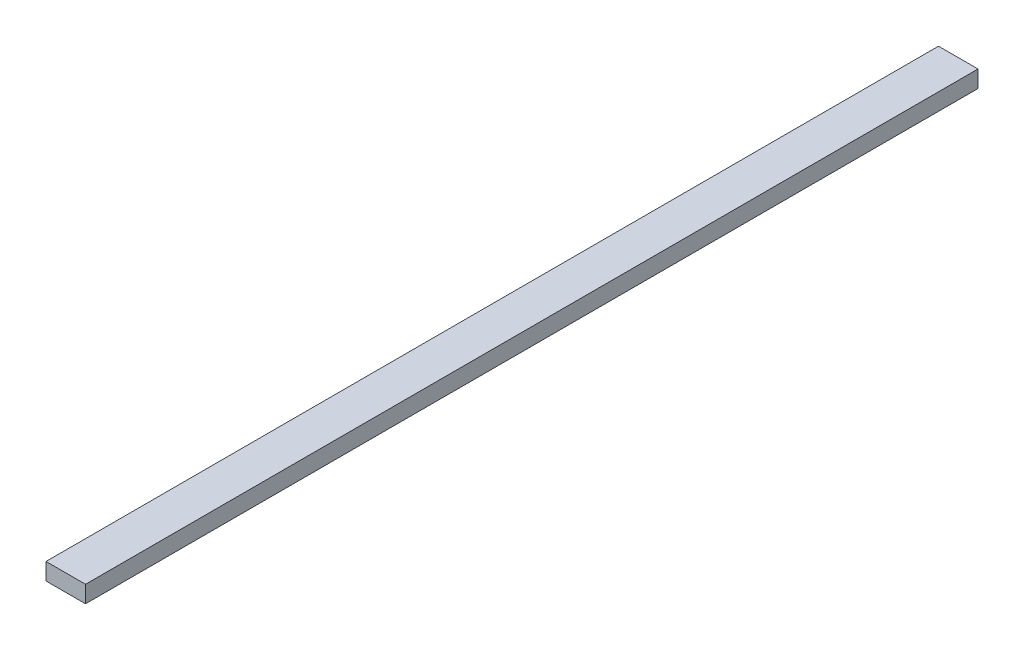
ISO-10303-21;
HEADER;
FILE_DESCRIPTION(('STEP AP214'),'2;1');
FILE_NAME('part.step','',(''),(''),'','','');
FILE_SCHEMA(('AUTOMOTIVE_DESIGN { 1 0 10303 214 1 1 1 1 }'));
ENDSEC;
DATA;
#1=APPLICATION_CONTEXT('core data for automotive mechanical design processes');
#2=APPLICATION_PROTOCOL_DEFINITION('international standard','automotive_design',2000,#1);
#3=PRODUCT_CONTEXT('',#1,'mechanical');
#4=PRODUCT('Part','Part','',(#3));
#5=PRODUCT_RELATED_PRODUCT_CATEGORY('part','',(#4));
#6=PRODUCT_DEFINITION_FORMATION('','',#4);
#7=PRODUCT_DEFINITION_CONTEXT('part definition',#1,'design');
#8=PRODUCT_DEFINITION('design','',#6,#7);
#9=PRODUCT_DEFINITION_SHAPE('','',#8);
#10=(LENGTH_UNIT() NAMED_UNIT(*) SI_UNIT(.MILLI.,.METRE.));
#11=(NAMED_UNIT(*) PLANE_ANGLE_UNIT() SI_UNIT($,.RADIAN.));
#12=(NAMED_UNIT(*) SI_UNIT($,.STERADIAN.) SOLID_ANGLE_UNIT());
#13=UNCERTAINTY_MEASURE_WITH_UNIT(LENGTH_MEASURE(1.E-05),#10,'distance_accuracy_value','');
#14=(GEOMETRIC_REPRESENTATION_CONTEXT(3) GLOBAL_UNCERTAINTY_ASSIGNED_CONTEXT((#13)) GLOBAL_UNIT_ASSIGNED_CONTEXT((#10,
#11,#12)) REPRESENTATION_CONTEXT('',''));
#15=CARTESIAN_POINT('',(0.,0.,0.));
#16=DIRECTION('',(0.,0.,1.));
#17=DIRECTION('',(1.,0.,0.));
#18=AXIS2_PLACEMENT_3D('',#15,#16,#17);
#19=CARTESIAN_POINT('',(-44.4500000000001,0.,1003.968750123));
#20=DIRECTION('',(0.,-1.,0.));
#21=DIRECTION('',(1.,0.,0.));
#22=AXIS2_PLACEMENT_3D('',#19,#20,#21);
#23=PLANE('',#22);
#24=DIRECTION('',(-1.,0.,0.));
#25=VECTOR('',#24,1.);
#26=CARTESIAN_POINT('',(-44.4500000000001,0.,-1003.968750123));
#27=LINE('',#26,#25);
#28=CARTESIAN_POINT('',(44.4500000000001,0.,-1003.968750123));
#29=VERTEX_POINT('',#28);
#30=CARTESIAN_POINT('',(-44.4500000000001,0.,-1003.968750123));
#31=VERTEX_POINT('',#30);
#32=EDGE_CURVE('E97',#29,#31,#27,.T.);
#33=ORIENTED_EDGE('',*,*,#32,.T.);
#34=DIRECTION('',(0.,0.,-1.));
#35=VECTOR('',#34,1.);
#36=CARTESIAN_POINT('',(-44.4500000000001,0.,1003.968750123));
#37=LINE('',#36,#35);
#38=CARTESIAN_POINT('',(-44.4500000000001,0.,1003.968750123));
#39=VERTEX_POINT('',#38);
#40=EDGE_CURVE('E11',#39,#31,#37,.T.);
#41=ORIENTED_EDGE('',*,*,#40,.F.);
#42=DIRECTION('',(-1.,0.,0.));
#43=VECTOR('',#42,1.);
#44=CARTESIAN_POINT('',(-44.4500000000001,0.,1003.968750123));
#45=LINE('',#44,#43);
#46=CARTESIAN_POINT('',(44.4500000000001,0.,1003.968750123));
#47=VERTEX_POINT('',#46);
#48=EDGE_CURVE('E85',#47,#39,#45,.T.);
#49=ORIENTED_EDGE('',*,*,#48,.F.);
#50=DIRECTION('',(0.,0.,-1.));
#51=VECTOR('',#50,1.);
#52=CARTESIAN_POINT('',(44.4500000000001,0.,1003.968750123));
#53=LINE('',#52,#51);
#54=EDGE_CURVE('E93',#47,#29,#53,.T.);
#55=ORIENTED_EDGE('',*,*,#54,.T.);
#56=EDGE_LOOP('',(#33,#41,#49,#55));
#57=FACE_BOUND('',#56,.T.);
#58=ADVANCED_FACE('F34',(#57),#23,.F.);
#59=CARTESIAN_POINT('',(-44.4500000000001,-38.0999999999999,1003.968750123));
#60=DIRECTION('',(1.,0.,0.));
#61=DIRECTION('',(0.,0.,-1.));
#62=AXIS2_PLACEMENT_3D('',#59,#60,#61);
#63=PLANE('',#62);
#64=DIRECTION('',(0.,-1.,0.));
#65=VECTOR('',#64,1.);
#66=CARTESIAN_POINT('',(-44.4500000000001,-38.0999999999999,-1003.968750123));
#67=LINE('',#66,#65);
#68=CARTESIAN_POINT('',(-44.4500000000001,-38.0999999999999,-1003.968750123));
#69=VERTEX_POINT('',#68);
#70=EDGE_CURVE('E89',#31,#69,#67,.T.);
#71=ORIENTED_EDGE('',*,*,#70,.T.);
#72=DIRECTION('',(0.,0.,-1.));
#73=VECTOR('',#72,1.);
#74=CARTESIAN_POINT('',(-44.4500000000001,-38.0999999999999,1003.968750123));
#75=LINE('',#74,#73);
#76=CARTESIAN_POINT('',(-44.4500000000001,-38.0999999999999,1003.968750123));
#77=VERTEX_POINT('',#76);
#78=EDGE_CURVE('E42',#77,#69,#75,.T.);
#79=ORIENTED_EDGE('',*,*,#78,.F.);
#80=DIRECTION('',(0.,-1.,0.));
#81=VECTOR('',#80,1.);
#82=CARTESIAN_POINT('',(-44.4500000000001,-38.0999999999999,1003.968750123));
#83=LINE('',#82,#81);
#84=EDGE_CURVE('E80',#39,#77,#83,.T.);
#85=ORIENTED_EDGE('',*,*,#84,.F.);
#86=ORIENTED_EDGE('',*,*,#40,.T.);
#87=EDGE_LOOP('',(#71,#79,#85,#86));
#88=FACE_BOUND('',#87,.T.);
#89=ADVANCED_FACE('F88',(#88),#63,.F.);
#90=CARTESIAN_POINT('',(44.4500000000001,-38.0999999999999,1003.968750123));
#91=DIRECTION('',(0.,1.,0.));
#92=DIRECTION('',(-1.,0.,0.));
#93=AXIS2_PLACEMENT_3D('',#90,#91,#92);
#94=PLANE('',#93);
#95=DIRECTION('',(1.,0.,0.));
#96=VECTOR('',#95,1.);
#97=CARTESIAN_POINT('',(44.4500000000001,-38.0999999999999,-1003.968750123));
#98=LINE('',#97,#96);
#99=CARTESIAN_POINT('',(44.4500000000001,-38.0999999999999,-1003.968750123));
#100=VERTEX_POINT('',#99);
#101=EDGE_CURVE('E67',#69,#100,#98,.T.);
#102=ORIENTED_EDGE('',*,*,#101,.T.);
#103=DIRECTION('',(0.,0.,-1.));
#104=VECTOR('',#103,1.);
#105=CARTESIAN_POINT('',(44.4500000000001,-38.0999999999999,1003.968750123));
#106=LINE('',#105,#104);
#107=CARTESIAN_POINT('',(44.4500000000001,-38.0999999999999,1003.968750123));
#108=VERTEX_POINT('',#107);
#109=EDGE_CURVE('E90',#108,#100,#106,.T.);
#110=ORIENTED_EDGE('',*,*,#109,.F.);
#111=DIRECTION('',(1.,0.,0.));
#112=VECTOR('',#111,1.);
#113=CARTESIAN_POINT('',(44.4500000000001,-38.0999999999999,1003.968750123));
#114=LINE('',#113,#112);
#115=EDGE_CURVE('E83',#77,#108,#114,.T.);
#116=ORIENTED_EDGE('',*,*,#115,.F.);
#117=ORIENTED_EDGE('',*,*,#78,.T.);
#118=EDGE_LOOP('',(#102,#110,#116,#117));
#119=FACE_BOUND('',#118,.T.);
#120=ADVANCED_FACE('F91',(#119),#94,.F.);
#121=CARTESIAN_POINT('',(44.4500000000001,0.,1003.968750123));
#122=DIRECTION('',(-1.,0.,0.));
#123=DIRECTION('',(0.,0.,1.));
#124=AXIS2_PLACEMENT_3D('',#121,#122,#123);
#125=PLANE('',#124);
#126=DIRECTION('',(0.,1.,0.));
#127=VECTOR('',#126,1.);
#128=CARTESIAN_POINT('',(44.4500000000001,0.,-1003.968750123));
#129=LINE('',#128,#127);
#130=EDGE_CURVE('E73',#100,#29,#129,.T.);
#131=ORIENTED_EDGE('',*,*,#130,.T.);
#132=ORIENTED_EDGE('',*,*,#54,.F.);
#133=DIRECTION('',(0.,1.,0.));
#134=VECTOR('',#133,1.);
#135=CARTESIAN_POINT('',(44.4500000000001,0.,1003.968750123));
#136=LINE('',#135,#134);
#137=EDGE_CURVE('E50',#108,#47,#136,.T.);
#138=ORIENTED_EDGE('',*,*,#137,.F.);
#139=ORIENTED_EDGE('',*,*,#109,.T.);
#140=EDGE_LOOP('',(#131,#132,#138,#139));
#141=FACE_BOUND('',#140,.T.);
#142=ADVANCED_FACE('F104',(#141),#125,.F.);
#143=CARTESIAN_POINT('',(0.,0.,1003.968750123));
#144=DIRECTION('',(0.,0.,-1.));
#145=DIRECTION('',(-1.,0.,0.));
#146=AXIS2_PLACEMENT_3D('',#143,#144,#145);
#147=PLANE('',#146);
#148=ORIENTED_EDGE('',*,*,#48,.T.);
#149=ORIENTED_EDGE('',*,*,#84,.T.);
#150=ORIENTED_EDGE('',*,*,#115,.T.);
#151=ORIENTED_EDGE('',*,*,#137,.T.);
#152=EDGE_LOOP('',(#148,#149,#150,#151));
#153=FACE_BOUND('',#152,.T.);
#154=ADVANCED_FACE('F81',(#153),#147,.F.);
#155=CARTESIAN_POINT('',(0.,0.,-1003.968750123));
#156=DIRECTION('',(0.,0.,-1.));
#157=DIRECTION('',(-1.,0.,0.));
#158=AXIS2_PLACEMENT_3D('',#155,#156,#157);
#159=PLANE('',#158);
#160=ORIENTED_EDGE('',*,*,#32,.F.);
#161=ORIENTED_EDGE('',*,*,#130,.F.);
#162=ORIENTED_EDGE('',*,*,#101,.F.);
#163=ORIENTED_EDGE('',*,*,#70,.F.);
#164=EDGE_LOOP('',(#160,#161,#162,#163));
#165=FACE_BOUND('',#164,.T.);
#166=ADVANCED_FACE('F107',(#165),#159,.T.);
#167=CLOSED_SHELL('',(#58,#89,#120,#142,#154,#166));
#168=MANIFOLD_SOLID_BREP('B2',#167);
#169=ADVANCED_BREP_SHAPE_REPRESENTATION('',(#18,#168),#14);
#170=SHAPE_DEFINITION_REPRESENTATION(#9,#169);
ENDSEC;
END-ISO-10303-21;
